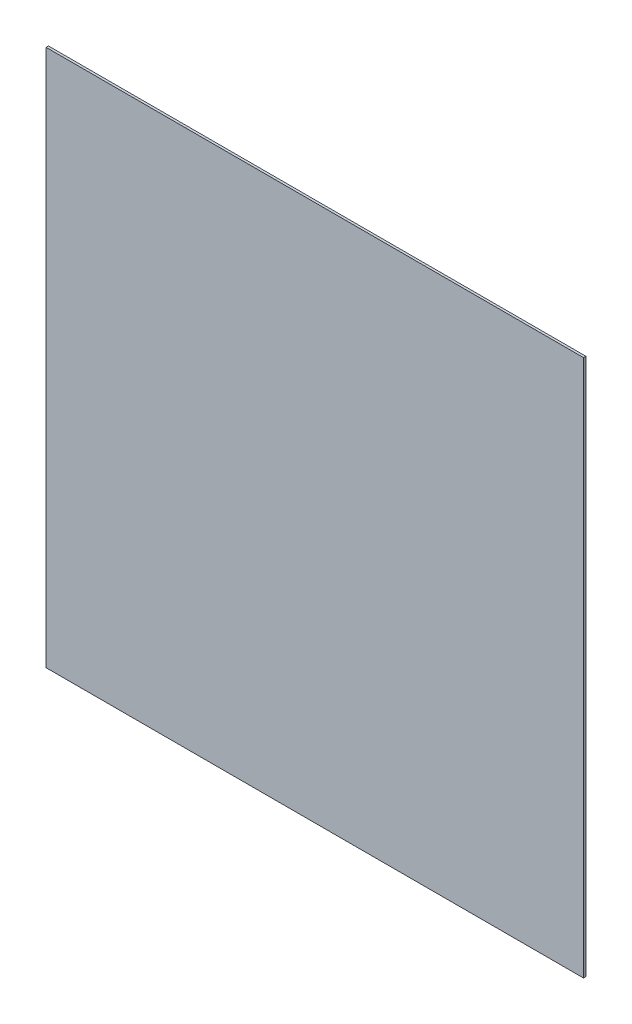
ISO-10303-21;
HEADER;
FILE_DESCRIPTION(('STEP AP214'),'2;1');
FILE_NAME('part.step','',(''),(''),'','','');
FILE_SCHEMA(('AUTOMOTIVE_DESIGN { 1 0 10303 214 1 1 1 1 }'));
ENDSEC;
DATA;
#1=APPLICATION_CONTEXT('core data for automotive mechanical design processes');
#2=APPLICATION_PROTOCOL_DEFINITION('international standard','automotive_design',2000,#1);
#3=PRODUCT_CONTEXT('',#1,'mechanical');
#4=PRODUCT('Part','Part','',(#3));
#5=PRODUCT_RELATED_PRODUCT_CATEGORY('part','',(#4));
#6=PRODUCT_DEFINITION_FORMATION('','',#4);
#7=PRODUCT_DEFINITION_CONTEXT('part definition',#1,'design');
#8=PRODUCT_DEFINITION('design','',#6,#7);
#9=PRODUCT_DEFINITION_SHAPE('','',#8);
#10=(LENGTH_UNIT() NAMED_UNIT(*) SI_UNIT(.MILLI.,.METRE.));
#11=(NAMED_UNIT(*) PLANE_ANGLE_UNIT() SI_UNIT($,.RADIAN.));
#12=(NAMED_UNIT(*) SI_UNIT($,.STERADIAN.) SOLID_ANGLE_UNIT());
#13=UNCERTAINTY_MEASURE_WITH_UNIT(LENGTH_MEASURE(1.E-05),#10,'distance_accuracy_value','');
#14=(GEOMETRIC_REPRESENTATION_CONTEXT(3) GLOBAL_UNCERTAINTY_ASSIGNED_CONTEXT((#13)) GLOBAL_UNIT_ASSIGNED_CONTEXT((#10,
#11,#12)) REPRESENTATION_CONTEXT('',''));
#15=CARTESIAN_POINT('',(0.,0.,0.));
#16=DIRECTION('',(0.,0.,1.));
#17=DIRECTION('',(1.,0.,0.));
#18=AXIS2_PLACEMENT_3D('',#15,#16,#17);
#19=CARTESIAN_POINT('',(-150.,150.,1.325));
#20=DIRECTION('',(1.,0.,0.));
#21=DIRECTION('',(0.,1.,0.));
#22=AXIS2_PLACEMENT_3D('',#19,#20,#21);
#23=PLANE('',#22);
#24=DIRECTION('',(0.,-1.,0.));
#25=VECTOR('',#24,1.);
#26=CARTESIAN_POINT('',(-150.,150.,0.));
#27=LINE('',#26,#25);
#28=CARTESIAN_POINT('',(-150.,150.,0.));
#29=VERTEX_POINT('',#28);
#30=CARTESIAN_POINT('',(-150.,-150.,0.));
#31=VERTEX_POINT('',#30);
#32=EDGE_CURVE('E96',#29,#31,#27,.T.);
#33=ORIENTED_EDGE('',*,*,#32,.T.);
#34=DIRECTION('',(0.,0.,-1.));
#35=VECTOR('',#34,1.);
#36=CARTESIAN_POINT('',(-150.,-150.,1.325));
#37=LINE('',#36,#35);
#38=CARTESIAN_POINT('',(-150.,-150.,1.325));
#39=VERTEX_POINT('',#38);
#40=EDGE_CURVE('E11',#39,#31,#37,.T.);
#41=ORIENTED_EDGE('',*,*,#40,.F.);
#42=DIRECTION('',(0.,-1.,0.));
#43=VECTOR('',#42,1.);
#44=CARTESIAN_POINT('',(-150.,150.,1.325));
#45=LINE('',#44,#43);
#46=CARTESIAN_POINT('',(-150.,150.,1.325));
#47=VERTEX_POINT('',#46);
#48=EDGE_CURVE('E84',#47,#39,#45,.T.);
#49=ORIENTED_EDGE('',*,*,#48,.F.);
#50=DIRECTION('',(0.,0.,-1.));
#51=VECTOR('',#50,1.);
#52=CARTESIAN_POINT('',(-150.,150.,1.325));
#53=LINE('',#52,#51);
#54=EDGE_CURVE('E92',#47,#29,#53,.T.);
#55=ORIENTED_EDGE('',*,*,#54,.T.);
#56=EDGE_LOOP('',(#33,#41,#49,#55));
#57=FACE_BOUND('',#56,.T.);
#58=ADVANCED_FACE('F33',(#57),#23,.F.);
#59=CARTESIAN_POINT('',(-150.,-150.,1.325));
#60=DIRECTION('',(0.,1.,0.));
#61=DIRECTION('',(0.,0.,1.));
#62=AXIS2_PLACEMENT_3D('',#59,#60,#61);
#63=PLANE('',#62);
#64=DIRECTION('',(1.,0.,0.));
#65=VECTOR('',#64,1.);
#66=CARTESIAN_POINT('',(-150.,-150.,0.));
#67=LINE('',#66,#65);
#68=CARTESIAN_POINT('',(150.,-150.,0.));
#69=VERTEX_POINT('',#68);
#70=EDGE_CURVE('E88',#31,#69,#67,.T.);
#71=ORIENTED_EDGE('',*,*,#70,.T.);
#72=DIRECTION('',(0.,0.,-1.));
#73=VECTOR('',#72,1.);
#74=CARTESIAN_POINT('',(150.,-150.,1.325));
#75=LINE('',#74,#73);
#76=CARTESIAN_POINT('',(150.,-150.,1.325));
#77=VERTEX_POINT('',#76);
#78=EDGE_CURVE('E41',#77,#69,#75,.T.);
#79=ORIENTED_EDGE('',*,*,#78,.F.);
#80=DIRECTION('',(1.,0.,0.));
#81=VECTOR('',#80,1.);
#82=CARTESIAN_POINT('',(-150.,-150.,1.325));
#83=LINE('',#82,#81);
#84=EDGE_CURVE('E79',#39,#77,#83,.T.);
#85=ORIENTED_EDGE('',*,*,#84,.F.);
#86=ORIENTED_EDGE('',*,*,#40,.T.);
#87=EDGE_LOOP('',(#71,#79,#85,#86));
#88=FACE_BOUND('',#87,.T.);
#89=ADVANCED_FACE('F87',(#88),#63,.F.);
#90=CARTESIAN_POINT('',(150.,150.,1.325));
#91=DIRECTION('',(-1.,0.,0.));
#92=DIRECTION('',(0.,-1.,0.));
#93=AXIS2_PLACEMENT_3D('',#90,#91,#92);
#94=PLANE('',#93);
#95=DIRECTION('',(0.,1.,0.));
#96=VECTOR('',#95,1.);
#97=CARTESIAN_POINT('',(150.,150.,0.));
#98=LINE('',#97,#96);
#99=CARTESIAN_POINT('',(150.,150.,0.));
#100=VERTEX_POINT('',#99);
#101=EDGE_CURVE('E66',#69,#100,#98,.T.);
#102=ORIENTED_EDGE('',*,*,#101,.T.);
#103=DIRECTION('',(0.,0.,-1.));
#104=VECTOR('',#103,1.);
#105=CARTESIAN_POINT('',(150.,150.,1.325));
#106=LINE('',#105,#104);
#107=CARTESIAN_POINT('',(150.,150.,1.325));
#108=VERTEX_POINT('',#107);
#109=EDGE_CURVE('E89',#108,#100,#106,.T.);
#110=ORIENTED_EDGE('',*,*,#109,.F.);
#111=DIRECTION('',(0.,1.,0.));
#112=VECTOR('',#111,1.);
#113=CARTESIAN_POINT('',(150.,150.,1.325));
#114=LINE('',#113,#112);
#115=EDGE_CURVE('E82',#77,#108,#114,.T.);
#116=ORIENTED_EDGE('',*,*,#115,.F.);
#117=ORIENTED_EDGE('',*,*,#78,.T.);
#118=EDGE_LOOP('',(#102,#110,#116,#117));
#119=FACE_BOUND('',#118,.T.);
#120=ADVANCED_FACE('F90',(#119),#94,.F.);
#121=CARTESIAN_POINT('',(-150.,150.,1.325));
#122=DIRECTION('',(0.,-1.,0.));
#123=DIRECTION('',(0.,0.,-1.));
#124=AXIS2_PLACEMENT_3D('',#121,#122,#123);
#125=PLANE('',#124);
#126=DIRECTION('',(-1.,0.,0.));
#127=VECTOR('',#126,1.);
#128=CARTESIAN_POINT('',(-150.,150.,0.));
#129=LINE('',#128,#127);
#130=EDGE_CURVE('E72',#100,#29,#129,.T.);
#131=ORIENTED_EDGE('',*,*,#130,.T.);
#132=ORIENTED_EDGE('',*,*,#54,.F.);
#133=DIRECTION('',(-1.,0.,0.));
#134=VECTOR('',#133,1.);
#135=CARTESIAN_POINT('',(-150.,150.,1.325));
#136=LINE('',#135,#134);
#137=EDGE_CURVE('E49',#108,#47,#136,.T.);
#138=ORIENTED_EDGE('',*,*,#137,.F.);
#139=ORIENTED_EDGE('',*,*,#109,.T.);
#140=EDGE_LOOP('',(#131,#132,#138,#139));
#141=FACE_BOUND('',#140,.T.);
#142=ADVANCED_FACE('F103',(#141),#125,.F.);
#143=CARTESIAN_POINT('',(-150.,-150.,1.325));
#144=DIRECTION('',(0.,0.,1.));
#145=DIRECTION('',(1.,0.,0.));
#146=AXIS2_PLACEMENT_3D('',#143,#144,#145);
#147=PLANE('',#146);
#148=ORIENTED_EDGE('',*,*,#48,.T.);
#149=ORIENTED_EDGE('',*,*,#84,.T.);
#150=ORIENTED_EDGE('',*,*,#115,.T.);
#151=ORIENTED_EDGE('',*,*,#137,.T.);
#152=EDGE_LOOP('',(#148,#149,#150,#151));
#153=FACE_BOUND('',#152,.T.);
#154=ADVANCED_FACE('F80',(#153),#147,.T.);
#155=CARTESIAN_POINT('',(-150.,-150.,0.));
#156=DIRECTION('',(0.,0.,1.));
#157=DIRECTION('',(1.,0.,0.));
#158=AXIS2_PLACEMENT_3D('',#155,#156,#157);
#159=PLANE('',#158);
#160=ORIENTED_EDGE('',*,*,#32,.F.);
#161=ORIENTED_EDGE('',*,*,#130,.F.);
#162=ORIENTED_EDGE('',*,*,#101,.F.);
#163=ORIENTED_EDGE('',*,*,#70,.F.);
#164=EDGE_LOOP('',(#160,#161,#162,#163));
#165=FACE_BOUND('',#164,.T.);
#166=ADVANCED_FACE('F106',(#165),#159,.F.);
#167=CLOSED_SHELL('',(#58,#89,#120,#142,#154,#166));
#168=MANIFOLD_SOLID_BREP('B2',#167);
#169=ADVANCED_BREP_SHAPE_REPRESENTATION('',(#18,#168),#14);
#170=SHAPE_DEFINITION_REPRESENTATION(#9,#169);
ENDSEC;
END-ISO-10303-21;
